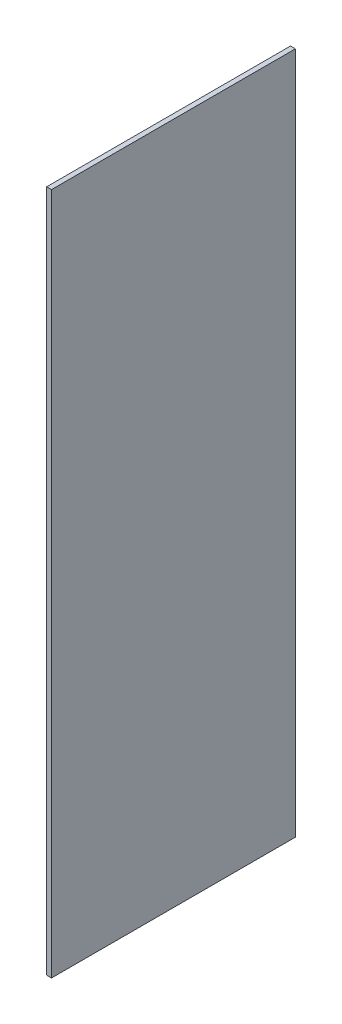
ISO-10303-21;
HEADER;
FILE_DESCRIPTION(('STEP AP214'),'2;1');
FILE_NAME('part.step','',(''),(''),'','','');
FILE_SCHEMA(('AUTOMOTIVE_DESIGN { 1 0 10303 214 1 1 1 1 }'));
ENDSEC;
DATA;
#1=APPLICATION_CONTEXT('core data for automotive mechanical design processes');
#2=APPLICATION_PROTOCOL_DEFINITION('international standard','automotive_design',2000,#1);
#3=PRODUCT_CONTEXT('',#1,'mechanical');
#4=PRODUCT('Part','Part','',(#3));
#5=PRODUCT_RELATED_PRODUCT_CATEGORY('part','',(#4));
#6=PRODUCT_DEFINITION_FORMATION('','',#4);
#7=PRODUCT_DEFINITION_CONTEXT('part definition',#1,'design');
#8=PRODUCT_DEFINITION('design','',#6,#7);
#9=PRODUCT_DEFINITION_SHAPE('','',#8);
#10=(LENGTH_UNIT() NAMED_UNIT(*) SI_UNIT(.MILLI.,.METRE.));
#11=(NAMED_UNIT(*) PLANE_ANGLE_UNIT() SI_UNIT($,.RADIAN.));
#12=(NAMED_UNIT(*) SI_UNIT($,.STERADIAN.) SOLID_ANGLE_UNIT());
#13=UNCERTAINTY_MEASURE_WITH_UNIT(LENGTH_MEASURE(1.E-05),#10,'distance_accuracy_value','');
#14=(GEOMETRIC_REPRESENTATION_CONTEXT(3) GLOBAL_UNCERTAINTY_ASSIGNED_CONTEXT((#13)) GLOBAL_UNIT_ASSIGNED_CONTEXT((#10,
#11,#12)) REPRESENTATION_CONTEXT('',''));
#15=CARTESIAN_POINT('',(0.,0.,0.));
#16=DIRECTION('',(0.,0.,1.));
#17=DIRECTION('',(1.,0.,0.));
#18=AXIS2_PLACEMENT_3D('',#15,#16,#17);
#19=CARTESIAN_POINT('',(0.,0.,5.));
#20=DIRECTION('',(1.,0.,0.));
#21=DIRECTION('',(0.,0.,-1.));
#22=AXIS2_PLACEMENT_3D('',#19,#20,#21);
#23=PLANE('',#22);
#24=DIRECTION('',(0.,-1.,0.));
#25=VECTOR('',#24,1.);
#26=CARTESIAN_POINT('',(0.,0.,0.));
#27=LINE('',#26,#25);
#28=CARTESIAN_POINT('',(0.,14.,0.));
#29=VERTEX_POINT('',#28);
#30=CARTESIAN_POINT('',(0.,0.,0.));
#31=VERTEX_POINT('',#30);
#32=EDGE_CURVE('E98',#29,#31,#27,.T.);
#33=ORIENTED_EDGE('',*,*,#32,.T.);
#34=DIRECTION('',(0.,0.,-1.));
#35=VECTOR('',#34,1.);
#36=CARTESIAN_POINT('',(0.,0.,5.));
#37=LINE('',#36,#35);
#38=CARTESIAN_POINT('',(0.,0.,5.));
#39=VERTEX_POINT('',#38);
#40=EDGE_CURVE('E11',#39,#31,#37,.T.);
#41=ORIENTED_EDGE('',*,*,#40,.F.);
#42=DIRECTION('',(0.,-1.,0.));
#43=VECTOR('',#42,1.);
#44=CARTESIAN_POINT('',(0.,0.,5.));
#45=LINE('',#44,#43);
#46=CARTESIAN_POINT('',(0.,14.,5.));
#47=VERTEX_POINT('',#46);
#48=EDGE_CURVE('E86',#47,#39,#45,.T.);
#49=ORIENTED_EDGE('',*,*,#48,.F.);
#50=DIRECTION('',(0.,0.,-1.));
#51=VECTOR('',#50,1.);
#52=CARTESIAN_POINT('',(0.,14.,5.));
#53=LINE('',#52,#51);
#54=EDGE_CURVE('E94',#47,#29,#53,.T.);
#55=ORIENTED_EDGE('',*,*,#54,.T.);
#56=EDGE_LOOP('',(#33,#41,#49,#55));
#57=FACE_BOUND('',#56,.T.);
#58=ADVANCED_FACE('F35',(#57),#23,.F.);
#59=CARTESIAN_POINT('',(0.,0.,5.));
#60=DIRECTION('',(0.,1.,0.));
#61=DIRECTION('',(0.,0.,1.));
#62=AXIS2_PLACEMENT_3D('',#59,#60,#61);
#63=PLANE('',#62);
#64=DIRECTION('',(1.,0.,0.));
#65=VECTOR('',#64,1.);
#66=CARTESIAN_POINT('',(0.,0.,0.));
#67=LINE('',#66,#65);
#68=CARTESIAN_POINT('',(0.1,0.,0.));
#69=VERTEX_POINT('',#68);
#70=EDGE_CURVE('E90',#31,#69,#67,.T.);
#71=ORIENTED_EDGE('',*,*,#70,.T.);
#72=DIRECTION('',(0.,0.,-1.));
#73=VECTOR('',#72,1.);
#74=CARTESIAN_POINT('',(0.1,0.,5.));
#75=LINE('',#74,#73);
#76=CARTESIAN_POINT('',(0.1,0.,5.));
#77=VERTEX_POINT('',#76);
#78=EDGE_CURVE('E43',#77,#69,#75,.T.);
#79=ORIENTED_EDGE('',*,*,#78,.F.);
#80=DIRECTION('',(1.,0.,0.));
#81=VECTOR('',#80,1.);
#82=CARTESIAN_POINT('',(0.,0.,5.));
#83=LINE('',#82,#81);
#84=EDGE_CURVE('E81',#39,#77,#83,.T.);
#85=ORIENTED_EDGE('',*,*,#84,.F.);
#86=ORIENTED_EDGE('',*,*,#40,.T.);
#87=EDGE_LOOP('',(#71,#79,#85,#86));
#88=FACE_BOUND('',#87,.T.);
#89=ADVANCED_FACE('F89',(#88),#63,.F.);
#90=CARTESIAN_POINT('',(0.1,0.,5.));
#91=DIRECTION('',(-1.,0.,0.));
#92=DIRECTION('',(0.,0.,1.));
#93=AXIS2_PLACEMENT_3D('',#90,#91,#92);
#94=PLANE('',#93);
#95=DIRECTION('',(0.,1.,0.));
#96=VECTOR('',#95,1.);
#97=CARTESIAN_POINT('',(0.1,0.,0.));
#98=LINE('',#97,#96);
#99=CARTESIAN_POINT('',(0.1,14.,0.));
#100=VERTEX_POINT('',#99);
#101=EDGE_CURVE('E68',#69,#100,#98,.T.);
#102=ORIENTED_EDGE('',*,*,#101,.T.);
#103=DIRECTION('',(0.,0.,-1.));
#104=VECTOR('',#103,1.);
#105=CARTESIAN_POINT('',(0.1,14.,5.));
#106=LINE('',#105,#104);
#107=CARTESIAN_POINT('',(0.1,14.,5.));
#108=VERTEX_POINT('',#107);
#109=EDGE_CURVE('E91',#108,#100,#106,.T.);
#110=ORIENTED_EDGE('',*,*,#109,.F.);
#111=DIRECTION('',(0.,1.,0.));
#112=VECTOR('',#111,1.);
#113=CARTESIAN_POINT('',(0.1,0.,5.));
#114=LINE('',#113,#112);
#115=EDGE_CURVE('E84',#77,#108,#114,.T.);
#116=ORIENTED_EDGE('',*,*,#115,.F.);
#117=ORIENTED_EDGE('',*,*,#78,.T.);
#118=EDGE_LOOP('',(#102,#110,#116,#117));
#119=FACE_BOUND('',#118,.T.);
#120=ADVANCED_FACE('F92',(#119),#94,.F.);
#121=CARTESIAN_POINT('',(0.,14.,5.));
#122=DIRECTION('',(0.,-1.,0.));
#123=DIRECTION('',(0.,0.,-1.));
#124=AXIS2_PLACEMENT_3D('',#121,#122,#123);
#125=PLANE('',#124);
#126=DIRECTION('',(-1.,0.,0.));
#127=VECTOR('',#126,1.);
#128=CARTESIAN_POINT('',(0.,14.,0.));
#129=LINE('',#128,#127);
#130=EDGE_CURVE('E74',#100,#29,#129,.T.);
#131=ORIENTED_EDGE('',*,*,#130,.T.);
#132=ORIENTED_EDGE('',*,*,#54,.F.);
#133=DIRECTION('',(-1.,0.,0.));
#134=VECTOR('',#133,1.);
#135=CARTESIAN_POINT('',(0.,14.,5.));
#136=LINE('',#135,#134);
#137=EDGE_CURVE('E51',#108,#47,#136,.T.);
#138=ORIENTED_EDGE('',*,*,#137,.F.);
#139=ORIENTED_EDGE('',*,*,#109,.T.);
#140=EDGE_LOOP('',(#131,#132,#138,#139));
#141=FACE_BOUND('',#140,.T.);
#142=ADVANCED_FACE('F105',(#141),#125,.F.);
#143=CARTESIAN_POINT('',(0.,0.,5.));
#144=DIRECTION('',(0.,0.,-1.));
#145=DIRECTION('',(-1.,0.,0.));
#146=AXIS2_PLACEMENT_3D('',#143,#144,#145);
#147=PLANE('',#146);
#148=ORIENTED_EDGE('',*,*,#48,.T.);
#149=ORIENTED_EDGE('',*,*,#84,.T.);
#150=ORIENTED_EDGE('',*,*,#115,.T.);
#151=ORIENTED_EDGE('',*,*,#137,.T.);
#152=EDGE_LOOP('',(#148,#149,#150,#151));
#153=FACE_BOUND('',#152,.T.);
#154=ADVANCED_FACE('F82',(#153),#147,.F.);
#155=CARTESIAN_POINT('',(0.,0.,0.));
#156=DIRECTION('',(0.,0.,-1.));
#157=DIRECTION('',(-1.,0.,0.));
#158=AXIS2_PLACEMENT_3D('',#155,#156,#157);
#159=PLANE('',#158);
#160=ORIENTED_EDGE('',*,*,#32,.F.);
#161=ORIENTED_EDGE('',*,*,#130,.F.);
#162=ORIENTED_EDGE('',*,*,#101,.F.);
#163=ORIENTED_EDGE('',*,*,#70,.F.);
#164=EDGE_LOOP('',(#160,#161,#162,#163));
#165=FACE_BOUND('',#164,.T.);
#166=ADVANCED_FACE('F108',(#165),#159,.T.);
#167=CLOSED_SHELL('',(#58,#89,#120,#142,#154,#166));
#168=MANIFOLD_SOLID_BREP('B2',#167);
#169=ADVANCED_BREP_SHAPE_REPRESENTATION('',(#18,#168),#14);
#170=SHAPE_DEFINITION_REPRESENTATION(#9,#169);
ENDSEC;
END-ISO-10303-21;
